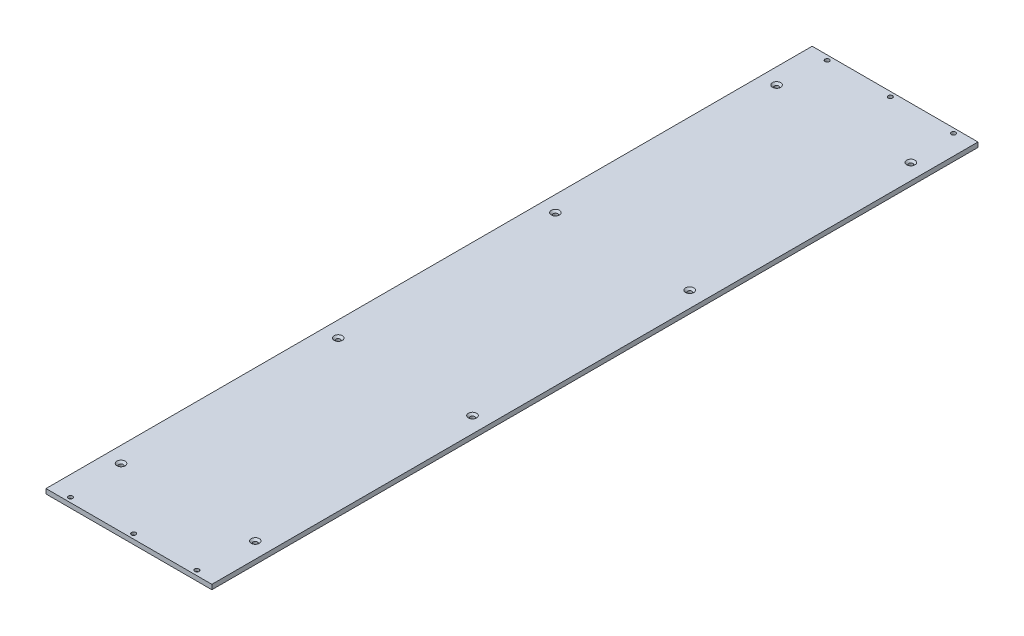
ISO-10303-21;
HEADER;
FILE_DESCRIPTION(('STEP AP214'),'2;1');
FILE_NAME('part.step','',(''),(''),'','','');
FILE_SCHEMA(('AUTOMOTIVE_DESIGN { 1 0 10303 214 1 1 1 1 }'));
ENDSEC;
DATA;
#1=APPLICATION_CONTEXT('core data for automotive mechanical design processes');
#2=APPLICATION_PROTOCOL_DEFINITION('international standard','automotive_design',2000,#1);
#3=PRODUCT_CONTEXT('',#1,'mechanical');
#4=PRODUCT('Part','Part','',(#3));
#5=PRODUCT_RELATED_PRODUCT_CATEGORY('part','',(#4));
#6=PRODUCT_DEFINITION_FORMATION('','',#4);
#7=PRODUCT_DEFINITION_CONTEXT('part definition',#1,'design');
#8=PRODUCT_DEFINITION('design','',#6,#7);
#9=PRODUCT_DEFINITION_SHAPE('','',#8);
#10=(LENGTH_UNIT() NAMED_UNIT(*) SI_UNIT(.MILLI.,.METRE.));
#11=(NAMED_UNIT(*) PLANE_ANGLE_UNIT() SI_UNIT($,.RADIAN.));
#12=(NAMED_UNIT(*) SI_UNIT($,.STERADIAN.) SOLID_ANGLE_UNIT());
#13=UNCERTAINTY_MEASURE_WITH_UNIT(LENGTH_MEASURE(1.E-05),#10,'distance_accuracy_value','');
#14=(GEOMETRIC_REPRESENTATION_CONTEXT(3) GLOBAL_UNCERTAINTY_ASSIGNED_CONTEXT((#13)) GLOBAL_UNIT_ASSIGNED_CONTEXT((#10,
#11,#12)) REPRESENTATION_CONTEXT('',''));
#15=CARTESIAN_POINT('',(0.,0.,0.));
#16=DIRECTION('',(0.,0.,1.));
#17=DIRECTION('',(1.,0.,0.));
#18=AXIS2_PLACEMENT_3D('',#15,#16,#17);
#19=CARTESIAN_POINT('',(0.,0.,0.));
#20=DIRECTION('',(0.,-1.,0.));
#21=DIRECTION('',(0.,0.,-1.));
#22=AXIS2_PLACEMENT_3D('',#19,#20,#21);
#23=PLANE('',#22);
#24=CARTESIAN_POINT('',(25.,0.,-964.));
#25=DIRECTION('',(0.,-1.,0.));
#26=DIRECTION('',(0.,0.,-1.));
#27=AXIS2_PLACEMENT_3D('',#24,#25,#26);
#28=CIRCLE('',#27,5.2);
#29=CARTESIAN_POINT('',(25.,0.,-969.2));
#30=VERTEX_POINT('',#29);
#31=EDGE_CURVE('E453',#30,#30,#28,.T.);
#32=ORIENTED_EDGE('',*,*,#31,.F.);
#33=EDGE_LOOP('',(#32));
#34=FACE_BOUND('',#33,.T.);
#35=CARTESIAN_POINT('',(185.,0.,-964.));
#36=DIRECTION('',(0.,-1.,0.));
#37=DIRECTION('',(0.,0.,-1.));
#38=AXIS2_PLACEMENT_3D('',#35,#36,#37);
#39=CIRCLE('',#38,5.20000000000001);
#40=CARTESIAN_POINT('',(185.,0.,-969.2));
#41=VERTEX_POINT('',#40);
#42=EDGE_CURVE('E459',#41,#41,#39,.T.);
#43=ORIENTED_EDGE('',*,*,#42,.F.);
#44=EDGE_LOOP('',(#43));
#45=FACE_BOUND('',#44,.T.);
#46=CARTESIAN_POINT('',(105.,0.,-964.));
#47=DIRECTION('',(0.,-1.,0.));
#48=DIRECTION('',(0.,0.,-1.));
#49=AXIS2_PLACEMENT_3D('',#46,#47,#48);
#50=CIRCLE('',#49,5.2);
#51=CARTESIAN_POINT('',(105.,0.,-969.2));
#52=VERTEX_POINT('',#51);
#53=EDGE_CURVE('E468',#52,#52,#50,.T.);
#54=ORIENTED_EDGE('',*,*,#53,.F.);
#55=EDGE_LOOP('',(#54));
#56=FACE_BOUND('',#55,.T.);
#57=CARTESIAN_POINT('',(25.,0.,-6.));
#58=DIRECTION('',(0.,-1.,0.));
#59=DIRECTION('',(0.,0.,-1.));
#60=AXIS2_PLACEMENT_3D('',#57,#58,#59);
#61=CIRCLE('',#60,5.2);
#62=CARTESIAN_POINT('',(25.,0.,-11.2));
#63=VERTEX_POINT('',#62);
#64=EDGE_CURVE('E477',#63,#63,#61,.T.);
#65=ORIENTED_EDGE('',*,*,#64,.F.);
#66=EDGE_LOOP('',(#65));
#67=FACE_BOUND('',#66,.T.);
#68=CARTESIAN_POINT('',(185.,0.,-6.));
#69=DIRECTION('',(0.,-1.,0.));
#70=DIRECTION('',(0.,0.,-1.));
#71=AXIS2_PLACEMENT_3D('',#68,#69,#70);
#72=CIRCLE('',#71,5.20000000000001);
#73=CARTESIAN_POINT('',(185.,0.,-11.2));
#74=VERTEX_POINT('',#73);
#75=EDGE_CURVE('E486',#74,#74,#72,.T.);
#76=ORIENTED_EDGE('',*,*,#75,.F.);
#77=EDGE_LOOP('',(#76));
#78=FACE_BOUND('',#77,.T.);
#79=CARTESIAN_POINT('',(105.,0.,-6.));
#80=DIRECTION('',(0.,-1.,0.));
#81=DIRECTION('',(0.,0.,-1.));
#82=AXIS2_PLACEMENT_3D('',#79,#80,#81);
#83=CIRCLE('',#82,5.2);
#84=CARTESIAN_POINT('',(105.,0.,-11.2));
#85=VERTEX_POINT('',#84);
#86=EDGE_CURVE('E495',#85,#85,#83,.T.);
#87=ORIENTED_EDGE('',*,*,#86,.F.);
#88=EDGE_LOOP('',(#87));
#89=FACE_BOUND('',#88,.T.);
#90=CARTESIAN_POINT('',(190.,0.,-905.));
#91=DIRECTION('',(0.,1.,0.));
#92=DIRECTION('',(0.,0.,1.));
#93=AXIS2_PLACEMENT_3D('',#90,#91,#92);
#94=CIRCLE('',#93,2.75);
#95=CARTESIAN_POINT('',(190.,0.,-902.25));
#96=VERTEX_POINT('',#95);
#97=EDGE_CURVE('E510',#96,#96,#94,.T.);
#98=ORIENTED_EDGE('',*,*,#97,.T.);
#99=EDGE_LOOP('',(#98));
#100=FACE_BOUND('',#99,.T.);
#101=CARTESIAN_POINT('',(20.,0.,-625.));
#102=DIRECTION('',(0.,1.,0.));
#103=DIRECTION('',(0.,0.,1.));
#104=AXIS2_PLACEMENT_3D('',#101,#102,#103);
#105=CIRCLE('',#104,2.75);
#106=CARTESIAN_POINT('',(20.,0.,-622.25));
#107=VERTEX_POINT('',#106);
#108=EDGE_CURVE('E42',#107,#107,#105,.T.);
#109=ORIENTED_EDGE('',*,*,#108,.T.);
#110=EDGE_LOOP('',(#109));
#111=FACE_BOUND('',#110,.T.);
#112=DIRECTION('',(0.,0.,1.));
#113=VECTOR('',#112,1.);
#114=CARTESIAN_POINT('',(0.,0.,0.));
#115=LINE('',#114,#113);
#116=CARTESIAN_POINT('',(0.,0.,-970.));
#117=VERTEX_POINT('',#116);
#118=CARTESIAN_POINT('',(0.,0.,0.));
#119=VERTEX_POINT('',#118);
#120=EDGE_CURVE('E102',#117,#119,#115,.T.);
#121=ORIENTED_EDGE('',*,*,#120,.F.);
#122=DIRECTION('',(-1.,0.,0.));
#123=VECTOR('',#122,1.);
#124=CARTESIAN_POINT('',(0.,0.,-970.));
#125=LINE('',#124,#123);
#126=CARTESIAN_POINT('',(210.,0.,-970.));
#127=VERTEX_POINT('',#126);
#128=EDGE_CURVE('E73',#127,#117,#125,.T.);
#129=ORIENTED_EDGE('',*,*,#128,.F.);
#130=DIRECTION('',(0.,0.,-1.));
#131=VECTOR('',#130,1.);
#132=CARTESIAN_POINT('',(210.,0.,0.));
#133=LINE('',#132,#131);
#134=CARTESIAN_POINT('',(210.,0.,0.));
#135=VERTEX_POINT('',#134);
#136=EDGE_CURVE('E67',#135,#127,#133,.T.);
#137=ORIENTED_EDGE('',*,*,#136,.F.);
#138=DIRECTION('',(1.,0.,0.));
#139=VECTOR('',#138,1.);
#140=CARTESIAN_POINT('',(0.,0.,0.));
#141=LINE('',#140,#139);
#142=EDGE_CURVE('E92',#119,#135,#141,.T.);
#143=ORIENTED_EDGE('',*,*,#142,.F.);
#144=EDGE_LOOP('',(#121,#129,#137,#143));
#145=FACE_BOUND('',#144,.T.);
#146=CARTESIAN_POINT('',(20.,0.,-75.));
#147=DIRECTION('',(0.,1.,0.));
#148=DIRECTION('',(0.,0.,1.));
#149=AXIS2_PLACEMENT_3D('',#146,#147,#148);
#150=CIRCLE('',#149,2.75);
#151=CARTESIAN_POINT('',(20.,0.,-72.25));
#152=VERTEX_POINT('',#151);
#153=EDGE_CURVE('E105',#152,#152,#150,.T.);
#154=ORIENTED_EDGE('',*,*,#153,.T.);
#155=EDGE_LOOP('',(#154));
#156=FACE_BOUND('',#155,.T.);
#157=CARTESIAN_POINT('',(20.,0.,-350.));
#158=DIRECTION('',(0.,1.,0.));
#159=DIRECTION('',(0.,0.,1.));
#160=AXIS2_PLACEMENT_3D('',#157,#158,#159);
#161=CIRCLE('',#160,2.75);
#162=CARTESIAN_POINT('',(20.,0.,-347.25));
#163=VERTEX_POINT('',#162);
#164=EDGE_CURVE('E552',#163,#163,#161,.T.);
#165=ORIENTED_EDGE('',*,*,#164,.T.);
#166=EDGE_LOOP('',(#165));
#167=FACE_BOUND('',#166,.T.);
#168=CARTESIAN_POINT('',(20.,0.,-905.));
#169=DIRECTION('',(0.,1.,0.));
#170=DIRECTION('',(0.,0.,1.));
#171=AXIS2_PLACEMENT_3D('',#168,#169,#170);
#172=CIRCLE('',#171,2.75);
#173=CARTESIAN_POINT('',(20.,0.,-902.25));
#174=VERTEX_POINT('',#173);
#175=EDGE_CURVE('E543',#174,#174,#172,.T.);
#176=ORIENTED_EDGE('',*,*,#175,.T.);
#177=EDGE_LOOP('',(#176));
#178=FACE_BOUND('',#177,.T.);
#179=CARTESIAN_POINT('',(190.,0.,-75.));
#180=DIRECTION('',(0.,1.,0.));
#181=DIRECTION('',(0.,0.,1.));
#182=AXIS2_PLACEMENT_3D('',#179,#180,#181);
#183=CIRCLE('',#182,2.75);
#184=CARTESIAN_POINT('',(190.,0.,-72.25));
#185=VERTEX_POINT('',#184);
#186=EDGE_CURVE('E537',#185,#185,#183,.T.);
#187=ORIENTED_EDGE('',*,*,#186,.T.);
#188=EDGE_LOOP('',(#187));
#189=FACE_BOUND('',#188,.T.);
#190=CARTESIAN_POINT('',(190.,0.,-350.));
#191=DIRECTION('',(0.,1.,0.));
#192=DIRECTION('',(0.,0.,1.));
#193=AXIS2_PLACEMENT_3D('',#190,#191,#192);
#194=CIRCLE('',#193,2.75);
#195=CARTESIAN_POINT('',(190.,0.,-347.25));
#196=VERTEX_POINT('',#195);
#197=EDGE_CURVE('E528',#196,#196,#194,.T.);
#198=ORIENTED_EDGE('',*,*,#197,.T.);
#199=EDGE_LOOP('',(#198));
#200=FACE_BOUND('',#199,.T.);
#201=CARTESIAN_POINT('',(190.,0.,-625.));
#202=DIRECTION('',(0.,1.,0.));
#203=DIRECTION('',(0.,0.,1.));
#204=AXIS2_PLACEMENT_3D('',#201,#202,#203);
#205=CIRCLE('',#204,2.75);
#206=CARTESIAN_POINT('',(190.,0.,-622.25));
#207=VERTEX_POINT('',#206);
#208=EDGE_CURVE('E519',#207,#207,#205,.T.);
#209=ORIENTED_EDGE('',*,*,#208,.T.);
#210=EDGE_LOOP('',(#209));
#211=FACE_BOUND('',#210,.T.);
#212=ADVANCED_FACE('F33',(#34,#45,#56,#67,#78,#89,#100,#111,#145,#156,#167,#178,#189,#200,#211),
#23,.T.);
#213=CARTESIAN_POINT('',(0.,6.,0.));
#214=DIRECTION('',(1.,0.,0.));
#215=DIRECTION('',(0.,0.,-1.));
#216=AXIS2_PLACEMENT_3D('',#213,#214,#215);
#217=PLANE('',#216);
#218=ORIENTED_EDGE('',*,*,#120,.T.);
#219=DIRECTION('',(0.,-1.,0.));
#220=VECTOR('',#219,1.);
#221=CARTESIAN_POINT('',(0.,6.,0.));
#222=LINE('',#221,#220);
#223=CARTESIAN_POINT('',(0.,6.,0.));
#224=VERTEX_POINT('',#223);
#225=EDGE_CURVE('E93',#224,#119,#222,.T.);
#226=ORIENTED_EDGE('',*,*,#225,.F.);
#227=DIRECTION('',(0.,0.,1.));
#228=VECTOR('',#227,1.);
#229=CARTESIAN_POINT('',(0.,6.,0.));
#230=LINE('',#229,#228);
#231=CARTESIAN_POINT('',(0.,6.,-970.));
#232=VERTEX_POINT('',#231);
#233=EDGE_CURVE('E87',#232,#224,#230,.T.);
#234=ORIENTED_EDGE('',*,*,#233,.F.);
#235=DIRECTION('',(0.,-1.,0.));
#236=VECTOR('',#235,1.);
#237=CARTESIAN_POINT('',(0.,6.,-970.));
#238=LINE('',#237,#236);
#239=EDGE_CURVE('E98',#232,#117,#238,.T.);
#240=ORIENTED_EDGE('',*,*,#239,.T.);
#241=EDGE_LOOP('',(#218,#226,#234,#240));
#242=FACE_BOUND('',#241,.T.);
#243=ADVANCED_FACE('F146',(#242),#217,.F.);
#244=CARTESIAN_POINT('',(0.,6.,0.));
#245=DIRECTION('',(0.,0.,-1.));
#246=DIRECTION('',(-1.,0.,0.));
#247=AXIS2_PLACEMENT_3D('',#244,#245,#246);
#248=PLANE('',#247);
#249=ORIENTED_EDGE('',*,*,#142,.T.);
#250=DIRECTION('',(0.,-1.,0.));
#251=VECTOR('',#250,1.);
#252=CARTESIAN_POINT('',(210.,6.,0.));
#253=LINE('',#252,#251);
#254=CARTESIAN_POINT('',(210.,6.,0.));
#255=VERTEX_POINT('',#254);
#256=EDGE_CURVE('E90',#255,#135,#253,.T.);
#257=ORIENTED_EDGE('',*,*,#256,.F.);
#258=DIRECTION('',(1.,0.,0.));
#259=VECTOR('',#258,1.);
#260=CARTESIAN_POINT('',(0.,6.,0.));
#261=LINE('',#260,#259);
#262=EDGE_CURVE('E81',#224,#255,#261,.T.);
#263=ORIENTED_EDGE('',*,*,#262,.F.);
#264=ORIENTED_EDGE('',*,*,#225,.T.);
#265=EDGE_LOOP('',(#249,#257,#263,#264));
#266=FACE_BOUND('',#265,.T.);
#267=ADVANCED_FACE('F91',(#266),#248,.F.);
#268=CARTESIAN_POINT('',(210.,6.,0.));
#269=DIRECTION('',(-1.,0.,0.));
#270=DIRECTION('',(0.,0.,1.));
#271=AXIS2_PLACEMENT_3D('',#268,#269,#270);
#272=PLANE('',#271);
#273=ORIENTED_EDGE('',*,*,#136,.T.);
#274=DIRECTION('',(0.,-1.,0.));
#275=VECTOR('',#274,1.);
#276=CARTESIAN_POINT('',(210.,6.,-970.));
#277=LINE('',#276,#275);
#278=CARTESIAN_POINT('',(210.,6.,-970.));
#279=VERTEX_POINT('',#278);
#280=EDGE_CURVE('E94',#279,#127,#277,.T.);
#281=ORIENTED_EDGE('',*,*,#280,.F.);
#282=DIRECTION('',(0.,0.,-1.));
#283=VECTOR('',#282,1.);
#284=CARTESIAN_POINT('',(210.,6.,0.));
#285=LINE('',#284,#283);
#286=EDGE_CURVE('E85',#255,#279,#285,.T.);
#287=ORIENTED_EDGE('',*,*,#286,.F.);
#288=ORIENTED_EDGE('',*,*,#256,.T.);
#289=EDGE_LOOP('',(#273,#281,#287,#288));
#290=FACE_BOUND('',#289,.T.);
#291=ADVANCED_FACE('F96',(#290),#272,.F.);
#292=CARTESIAN_POINT('',(0.,6.,-970.));
#293=DIRECTION('',(0.,0.,1.));
#294=DIRECTION('',(1.,0.,0.));
#295=AXIS2_PLACEMENT_3D('',#292,#293,#294);
#296=PLANE('',#295);
#297=ORIENTED_EDGE('',*,*,#128,.T.);
#298=ORIENTED_EDGE('',*,*,#239,.F.);
#299=DIRECTION('',(-1.,0.,0.));
#300=VECTOR('',#299,1.);
#301=CARTESIAN_POINT('',(0.,6.,-970.));
#302=LINE('',#301,#300);
#303=EDGE_CURVE('E50',#279,#232,#302,.T.);
#304=ORIENTED_EDGE('',*,*,#303,.F.);
#305=ORIENTED_EDGE('',*,*,#280,.T.);
#306=EDGE_LOOP('',(#297,#298,#304,#305));
#307=FACE_BOUND('',#306,.T.);
#308=ADVANCED_FACE('F131',(#307),#296,.F.);
#309=CARTESIAN_POINT('',(0.,6.,0.));
#310=DIRECTION('',(0.,-1.,0.));
#311=DIRECTION('',(0.,0.,-1.));
#312=AXIS2_PLACEMENT_3D('',#309,#310,#311);
#313=PLANE('',#312);
#314=CARTESIAN_POINT('',(25.,6.,-964.));
#315=DIRECTION('',(0.,-1.,0.));
#316=DIRECTION('',(0.,0.,-1.));
#317=AXIS2_PLACEMENT_3D('',#314,#315,#316);
#318=CIRCLE('',#317,2.75);
#319=CARTESIAN_POINT('',(25.,6.,-966.75));
#320=VERTEX_POINT('',#319);
#321=EDGE_CURVE('E455',#320,#320,#318,.T.);
#322=ORIENTED_EDGE('',*,*,#321,.T.);
#323=EDGE_LOOP('',(#322));
#324=FACE_BOUND('',#323,.T.);
#325=CARTESIAN_POINT('',(185.,6.,-964.));
#326=DIRECTION('',(0.,-1.,0.));
#327=DIRECTION('',(0.,0.,-1.));
#328=AXIS2_PLACEMENT_3D('',#325,#326,#327);
#329=CIRCLE('',#328,2.75);
#330=CARTESIAN_POINT('',(185.,6.,-966.75));
#331=VERTEX_POINT('',#330);
#332=EDGE_CURVE('E465',#331,#331,#329,.T.);
#333=ORIENTED_EDGE('',*,*,#332,.T.);
#334=EDGE_LOOP('',(#333));
#335=FACE_BOUND('',#334,.T.);
#336=CARTESIAN_POINT('',(105.,6.,-964.));
#337=DIRECTION('',(0.,-1.,0.));
#338=DIRECTION('',(0.,0.,-1.));
#339=AXIS2_PLACEMENT_3D('',#336,#337,#338);
#340=CIRCLE('',#339,2.75);
#341=CARTESIAN_POINT('',(105.,6.,-966.75));
#342=VERTEX_POINT('',#341);
#343=EDGE_CURVE('E474',#342,#342,#340,.T.);
#344=ORIENTED_EDGE('',*,*,#343,.T.);
#345=EDGE_LOOP('',(#344));
#346=FACE_BOUND('',#345,.T.);
#347=CARTESIAN_POINT('',(25.,6.,-6.));
#348=DIRECTION('',(0.,-1.,0.));
#349=DIRECTION('',(0.,0.,-1.));
#350=AXIS2_PLACEMENT_3D('',#347,#348,#349);
#351=CIRCLE('',#350,2.75);
#352=CARTESIAN_POINT('',(25.,6.,-8.75));
#353=VERTEX_POINT('',#352);
#354=EDGE_CURVE('E483',#353,#353,#351,.T.);
#355=ORIENTED_EDGE('',*,*,#354,.T.);
#356=EDGE_LOOP('',(#355));
#357=FACE_BOUND('',#356,.T.);
#358=CARTESIAN_POINT('',(185.,6.,-6.));
#359=DIRECTION('',(0.,-1.,0.));
#360=DIRECTION('',(0.,0.,-1.));
#361=AXIS2_PLACEMENT_3D('',#358,#359,#360);
#362=CIRCLE('',#361,2.75);
#363=CARTESIAN_POINT('',(185.,6.,-8.75));
#364=VERTEX_POINT('',#363);
#365=EDGE_CURVE('E492',#364,#364,#362,.T.);
#366=ORIENTED_EDGE('',*,*,#365,.T.);
#367=EDGE_LOOP('',(#366));
#368=FACE_BOUND('',#367,.T.);
#369=CARTESIAN_POINT('',(105.,6.,-6.));
#370=DIRECTION('',(0.,-1.,0.));
#371=DIRECTION('',(0.,0.,-1.));
#372=AXIS2_PLACEMENT_3D('',#369,#370,#371);
#373=CIRCLE('',#372,2.75);
#374=CARTESIAN_POINT('',(105.,6.,-8.75));
#375=VERTEX_POINT('',#374);
#376=EDGE_CURVE('E501',#375,#375,#373,.T.);
#377=ORIENTED_EDGE('',*,*,#376,.T.);
#378=EDGE_LOOP('',(#377));
#379=FACE_BOUND('',#378,.T.);
#380=CARTESIAN_POINT('',(190.,6.,-905.));
#381=DIRECTION('',(0.,1.,0.));
#382=DIRECTION('',(0.,0.,1.));
#383=AXIS2_PLACEMENT_3D('',#380,#381,#382);
#384=CIRCLE('',#383,5.20000000000001);
#385=CARTESIAN_POINT('',(190.,6.,-899.8));
#386=VERTEX_POINT('',#385);
#387=EDGE_CURVE('E504',#386,#386,#384,.T.);
#388=ORIENTED_EDGE('',*,*,#387,.F.);
#389=EDGE_LOOP('',(#388));
#390=FACE_BOUND('',#389,.T.);
#391=CARTESIAN_POINT('',(190.,6.,-625.));
#392=DIRECTION('',(0.,1.,0.));
#393=DIRECTION('',(0.,0.,1.));
#394=AXIS2_PLACEMENT_3D('',#391,#392,#393);
#395=CIRCLE('',#394,5.20000000000001);
#396=CARTESIAN_POINT('',(190.,6.,-619.8));
#397=VERTEX_POINT('',#396);
#398=EDGE_CURVE('E513',#397,#397,#395,.T.);
#399=ORIENTED_EDGE('',*,*,#398,.F.);
#400=EDGE_LOOP('',(#399));
#401=FACE_BOUND('',#400,.T.);
#402=CARTESIAN_POINT('',(190.,6.,-350.));
#403=DIRECTION('',(0.,1.,0.));
#404=DIRECTION('',(0.,0.,1.));
#405=AXIS2_PLACEMENT_3D('',#402,#403,#404);
#406=CIRCLE('',#405,5.20000000000001);
#407=CARTESIAN_POINT('',(190.,6.,-344.8));
#408=VERTEX_POINT('',#407);
#409=EDGE_CURVE('E522',#408,#408,#406,.T.);
#410=ORIENTED_EDGE('',*,*,#409,.F.);
#411=EDGE_LOOP('',(#410));
#412=FACE_BOUND('',#411,.T.);
#413=CARTESIAN_POINT('',(190.,6.,-75.));
#414=DIRECTION('',(0.,1.,0.));
#415=DIRECTION('',(0.,0.,1.));
#416=AXIS2_PLACEMENT_3D('',#413,#414,#415);
#417=CIRCLE('',#416,5.20000000000001);
#418=CARTESIAN_POINT('',(190.,6.,-69.8));
#419=VERTEX_POINT('',#418);
#420=EDGE_CURVE('E531',#419,#419,#417,.T.);
#421=ORIENTED_EDGE('',*,*,#420,.F.);
#422=EDGE_LOOP('',(#421));
#423=FACE_BOUND('',#422,.T.);
#424=CARTESIAN_POINT('',(20.,6.,-905.));
#425=DIRECTION('',(0.,1.,0.));
#426=DIRECTION('',(0.,0.,1.));
#427=AXIS2_PLACEMENT_3D('',#424,#425,#426);
#428=CIRCLE('',#427,5.2);
#429=CARTESIAN_POINT('',(20.,6.,-899.8));
#430=VERTEX_POINT('',#429);
#431=EDGE_CURVE('E540',#430,#430,#428,.T.);
#432=ORIENTED_EDGE('',*,*,#431,.F.);
#433=EDGE_LOOP('',(#432));
#434=FACE_BOUND('',#433,.T.);
#435=CARTESIAN_POINT('',(20.,6.,-350.));
#436=DIRECTION('',(0.,1.,0.));
#437=DIRECTION('',(0.,0.,1.));
#438=AXIS2_PLACEMENT_3D('',#435,#436,#437);
#439=CIRCLE('',#438,5.2);
#440=CARTESIAN_POINT('',(20.,6.,-344.8));
#441=VERTEX_POINT('',#440);
#442=EDGE_CURVE('E549',#441,#441,#439,.T.);
#443=ORIENTED_EDGE('',*,*,#442,.F.);
#444=EDGE_LOOP('',(#443));
#445=FACE_BOUND('',#444,.T.);
#446=CARTESIAN_POINT('',(20.,6.,-75.));
#447=DIRECTION('',(0.,1.,0.));
#448=DIRECTION('',(0.,0.,1.));
#449=AXIS2_PLACEMENT_3D('',#446,#447,#448);
#450=CIRCLE('',#449,5.2);
#451=CARTESIAN_POINT('',(20.,6.,-69.8));
#452=VERTEX_POINT('',#451);
#453=EDGE_CURVE('E558',#452,#452,#450,.T.);
#454=ORIENTED_EDGE('',*,*,#453,.F.);
#455=EDGE_LOOP('',(#454));
#456=FACE_BOUND('',#455,.T.);
#457=ORIENTED_EDGE('',*,*,#233,.T.);
#458=ORIENTED_EDGE('',*,*,#262,.T.);
#459=ORIENTED_EDGE('',*,*,#286,.T.);
#460=ORIENTED_EDGE('',*,*,#303,.T.);
#461=EDGE_LOOP('',(#457,#458,#459,#460));
#462=FACE_BOUND('',#461,.T.);
#463=CARTESIAN_POINT('',(20.,6.,-625.));
#464=DIRECTION('',(0.,1.,0.));
#465=DIRECTION('',(0.,0.,1.));
#466=AXIS2_PLACEMENT_3D('',#463,#464,#465);
#467=CIRCLE('',#466,5.2);
#468=CARTESIAN_POINT('',(20.,6.,-619.8));
#469=VERTEX_POINT('',#468);
#470=EDGE_CURVE('E112',#469,#469,#467,.T.);
#471=ORIENTED_EDGE('',*,*,#470,.F.);
#472=EDGE_LOOP('',(#471));
#473=FACE_BOUND('',#472,.T.);
#474=ADVANCED_FACE('F82',(#324,#335,#346,#357,#368,#379,#390,#401,#412,#423,#434,#445,#456,#462,
#473),#313,.F.);
#475=CARTESIAN_POINT('',(20.,6.,-75.));
#476=DIRECTION('',(0.,1.,0.));
#477=DIRECTION('',(0.,0.,1.));
#478=AXIS2_PLACEMENT_3D('',#475,#476,#477);
#479=CYLINDRICAL_SURFACE('',#478,2.75);
#480=ORIENTED_EDGE('',*,*,#153,.F.);
#481=EDGE_LOOP('',(#480));
#482=FACE_BOUND('',#481,.T.);
#483=CARTESIAN_POINT('',(20.,3.55,-75.));
#484=DIRECTION('',(0.,1.,0.));
#485=DIRECTION('',(0.,0.,1.));
#486=AXIS2_PLACEMENT_3D('',#483,#484,#485);
#487=CIRCLE('',#486,2.75);
#488=CARTESIAN_POINT('',(20.,3.55,-72.25));
#489=VERTEX_POINT('',#488);
#490=EDGE_CURVE('E561',#489,#489,#487,.T.);
#491=ORIENTED_EDGE('',*,*,#490,.T.);
#492=EDGE_LOOP('',(#491));
#493=FACE_BOUND('',#492,.T.);
#494=ADVANCED_FACE('F130',(#482,#493),#479,.F.);
#495=CARTESIAN_POINT('',(20.,6.,-75.));
#496=DIRECTION('',(0.,1.,0.));
#497=DIRECTION('',(0.,0.,1.));
#498=AXIS2_PLACEMENT_3D('',#495,#496,#497);
#499=CONICAL_SURFACE('',#498,5.2,0.785398163397448);
#500=ORIENTED_EDGE('',*,*,#490,.F.);
#501=EDGE_LOOP('',(#500));
#502=FACE_BOUND('',#501,.T.);
#503=ORIENTED_EDGE('',*,*,#453,.T.);
#504=EDGE_LOOP('',(#503));
#505=FACE_BOUND('',#504,.T.);
#506=ADVANCED_FACE('F138',(#502,#505),#499,.F.);
#507=CARTESIAN_POINT('',(20.,6.,-350.));
#508=DIRECTION('',(0.,1.,0.));
#509=DIRECTION('',(0.,0.,1.));
#510=AXIS2_PLACEMENT_3D('',#507,#508,#509);
#511=CYLINDRICAL_SURFACE('',#510,2.75);
#512=ORIENTED_EDGE('',*,*,#164,.F.);
#513=EDGE_LOOP('',(#512));
#514=FACE_BOUND('',#513,.T.);
#515=CARTESIAN_POINT('',(20.,3.55,-350.));
#516=DIRECTION('',(0.,1.,0.));
#517=DIRECTION('',(0.,0.,1.));
#518=AXIS2_PLACEMENT_3D('',#515,#516,#517);
#519=CIRCLE('',#518,2.75);
#520=CARTESIAN_POINT('',(20.,3.55,-347.25));
#521=VERTEX_POINT('',#520);
#522=EDGE_CURVE('E555',#521,#521,#519,.T.);
#523=ORIENTED_EDGE('',*,*,#522,.T.);
#524=EDGE_LOOP('',(#523));
#525=FACE_BOUND('',#524,.T.);
#526=ADVANCED_FACE('F187',(#514,#525),#511,.F.);
#527=CARTESIAN_POINT('',(20.,6.,-350.));
#528=DIRECTION('',(0.,1.,0.));
#529=DIRECTION('',(0.,0.,1.));
#530=AXIS2_PLACEMENT_3D('',#527,#528,#529);
#531=CONICAL_SURFACE('',#530,5.2,0.785398163397448);
#532=ORIENTED_EDGE('',*,*,#522,.F.);
#533=EDGE_LOOP('',(#532));
#534=FACE_BOUND('',#533,.T.);
#535=ORIENTED_EDGE('',*,*,#442,.T.);
#536=EDGE_LOOP('',(#535));
#537=FACE_BOUND('',#536,.T.);
#538=ADVANCED_FACE('F127',(#534,#537),#531,.F.);
#539=CARTESIAN_POINT('',(20.,6.,-625.));
#540=DIRECTION('',(0.,1.,0.));
#541=DIRECTION('',(0.,0.,1.));
#542=AXIS2_PLACEMENT_3D('',#539,#540,#541);
#543=CONICAL_SURFACE('',#542,5.2,0.785398163397448);
#544=CARTESIAN_POINT('',(20.,3.55,-625.));
#545=DIRECTION('',(0.,1.,0.));
#546=DIRECTION('',(0.,0.,1.));
#547=AXIS2_PLACEMENT_3D('',#544,#545,#546);
#548=CIRCLE('',#547,2.75);
#549=CARTESIAN_POINT('',(20.,3.55,-622.25));
#550=VERTEX_POINT('',#549);
#551=EDGE_CURVE('E11',#550,#550,#548,.T.);
#552=ORIENTED_EDGE('',*,*,#551,.F.);
#553=EDGE_LOOP('',(#552));
#554=FACE_BOUND('',#553,.T.);
#555=ORIENTED_EDGE('',*,*,#470,.T.);
#556=EDGE_LOOP('',(#555));
#557=FACE_BOUND('',#556,.T.);
#558=ADVANCED_FACE('F35',(#554,#557),#543,.F.);
#559=CARTESIAN_POINT('',(20.,6.,-625.));
#560=DIRECTION('',(0.,1.,0.));
#561=DIRECTION('',(0.,0.,1.));
#562=AXIS2_PLACEMENT_3D('',#559,#560,#561);
#563=CYLINDRICAL_SURFACE('',#562,2.75);
#564=ORIENTED_EDGE('',*,*,#108,.F.);
#565=EDGE_LOOP('',(#564));
#566=FACE_BOUND('',#565,.T.);
#567=ORIENTED_EDGE('',*,*,#551,.T.);
#568=EDGE_LOOP('',(#567));
#569=FACE_BOUND('',#568,.T.);
#570=ADVANCED_FACE('F119',(#566,#569),#563,.F.);
#571=CARTESIAN_POINT('',(20.,6.,-905.));
#572=DIRECTION('',(0.,1.,0.));
#573=DIRECTION('',(0.,0.,1.));
#574=AXIS2_PLACEMENT_3D('',#571,#572,#573);
#575=CYLINDRICAL_SURFACE('',#574,2.75);
#576=ORIENTED_EDGE('',*,*,#175,.F.);
#577=EDGE_LOOP('',(#576));
#578=FACE_BOUND('',#577,.T.);
#579=CARTESIAN_POINT('',(20.,3.55,-905.));
#580=DIRECTION('',(0.,1.,0.));
#581=DIRECTION('',(0.,0.,1.));
#582=AXIS2_PLACEMENT_3D('',#579,#580,#581);
#583=CIRCLE('',#582,2.75);
#584=CARTESIAN_POINT('',(20.,3.55,-902.25));
#585=VERTEX_POINT('',#584);
#586=EDGE_CURVE('E546',#585,#585,#583,.T.);
#587=ORIENTED_EDGE('',*,*,#586,.T.);
#588=EDGE_LOOP('',(#587));
#589=FACE_BOUND('',#588,.T.);
#590=ADVANCED_FACE('F122',(#578,#589),#575,.F.);
#591=CARTESIAN_POINT('',(20.,6.,-905.));
#592=DIRECTION('',(0.,1.,0.));
#593=DIRECTION('',(0.,0.,1.));
#594=AXIS2_PLACEMENT_3D('',#591,#592,#593);
#595=CONICAL_SURFACE('',#594,5.2,0.785398163397448);
#596=ORIENTED_EDGE('',*,*,#586,.F.);
#597=EDGE_LOOP('',(#596));
#598=FACE_BOUND('',#597,.T.);
#599=ORIENTED_EDGE('',*,*,#431,.T.);
#600=EDGE_LOOP('',(#599));
#601=FACE_BOUND('',#600,.T.);
#602=ADVANCED_FACE('F227',(#598,#601),#595,.F.);
#603=CARTESIAN_POINT('',(190.,6.,-75.));
#604=DIRECTION('',(0.,1.,0.));
#605=DIRECTION('',(0.,0.,1.));
#606=AXIS2_PLACEMENT_3D('',#603,#604,#605);
#607=CYLINDRICAL_SURFACE('',#606,2.75);
#608=ORIENTED_EDGE('',*,*,#186,.F.);
#609=EDGE_LOOP('',(#608));
#610=FACE_BOUND('',#609,.T.);
#611=CARTESIAN_POINT('',(190.,3.55,-75.));
#612=DIRECTION('',(0.,1.,0.));
#613=DIRECTION('',(0.,0.,1.));
#614=AXIS2_PLACEMENT_3D('',#611,#612,#613);
#615=CIRCLE('',#614,2.75);
#616=CARTESIAN_POINT('',(190.,3.55,-72.25));
#617=VERTEX_POINT('',#616);
#618=EDGE_CURVE('E534',#617,#617,#615,.T.);
#619=ORIENTED_EDGE('',*,*,#618,.T.);
#620=EDGE_LOOP('',(#619));
#621=FACE_BOUND('',#620,.T.);
#622=ADVANCED_FACE('F237',(#610,#621),#607,.F.);
#623=CARTESIAN_POINT('',(190.,6.,-75.));
#624=DIRECTION('',(0.,1.,0.));
#625=DIRECTION('',(0.,0.,1.));
#626=AXIS2_PLACEMENT_3D('',#623,#624,#625);
#627=CONICAL_SURFACE('',#626,5.20000000000001,0.785398163397449);
#628=ORIENTED_EDGE('',*,*,#618,.F.);
#629=EDGE_LOOP('',(#628));
#630=FACE_BOUND('',#629,.T.);
#631=ORIENTED_EDGE('',*,*,#420,.T.);
#632=EDGE_LOOP('',(#631));
#633=FACE_BOUND('',#632,.T.);
#634=ADVANCED_FACE('F248',(#630,#633),#627,.F.);
#635=CARTESIAN_POINT('',(190.,6.,-350.));
#636=DIRECTION('',(0.,1.,0.));
#637=DIRECTION('',(0.,0.,1.));
#638=AXIS2_PLACEMENT_3D('',#635,#636,#637);
#639=CYLINDRICAL_SURFACE('',#638,2.75);
#640=ORIENTED_EDGE('',*,*,#197,.F.);
#641=EDGE_LOOP('',(#640));
#642=FACE_BOUND('',#641,.T.);
#643=CARTESIAN_POINT('',(190.,3.55,-350.));
#644=DIRECTION('',(0.,1.,0.));
#645=DIRECTION('',(0.,0.,1.));
#646=AXIS2_PLACEMENT_3D('',#643,#644,#645);
#647=CIRCLE('',#646,2.75);
#648=CARTESIAN_POINT('',(190.,3.55,-347.25));
#649=VERTEX_POINT('',#648);
#650=EDGE_CURVE('E525',#649,#649,#647,.T.);
#651=ORIENTED_EDGE('',*,*,#650,.T.);
#652=EDGE_LOOP('',(#651));
#653=FACE_BOUND('',#652,.T.);
#654=ADVANCED_FACE('F258',(#642,#653),#639,.F.);
#655=CARTESIAN_POINT('',(190.,6.,-350.));
#656=DIRECTION('',(0.,1.,0.));
#657=DIRECTION('',(0.,0.,1.));
#658=AXIS2_PLACEMENT_3D('',#655,#656,#657);
#659=CONICAL_SURFACE('',#658,5.20000000000001,0.785398163397449);
#660=ORIENTED_EDGE('',*,*,#650,.F.);
#661=EDGE_LOOP('',(#660));
#662=FACE_BOUND('',#661,.T.);
#663=ORIENTED_EDGE('',*,*,#409,.T.);
#664=EDGE_LOOP('',(#663));
#665=FACE_BOUND('',#664,.T.);
#666=ADVANCED_FACE('F268',(#662,#665),#659,.F.);
#667=CARTESIAN_POINT('',(190.,6.,-625.));
#668=DIRECTION('',(0.,1.,0.));
#669=DIRECTION('',(0.,0.,1.));
#670=AXIS2_PLACEMENT_3D('',#667,#668,#669);
#671=CYLINDRICAL_SURFACE('',#670,2.75);
#672=ORIENTED_EDGE('',*,*,#208,.F.);
#673=EDGE_LOOP('',(#672));
#674=FACE_BOUND('',#673,.T.);
#675=CARTESIAN_POINT('',(190.,3.55,-625.));
#676=DIRECTION('',(0.,1.,0.));
#677=DIRECTION('',(0.,0.,1.));
#678=AXIS2_PLACEMENT_3D('',#675,#676,#677);
#679=CIRCLE('',#678,2.75);
#680=CARTESIAN_POINT('',(190.,3.55,-622.25));
#681=VERTEX_POINT('',#680);
#682=EDGE_CURVE('E516',#681,#681,#679,.T.);
#683=ORIENTED_EDGE('',*,*,#682,.T.);
#684=EDGE_LOOP('',(#683));
#685=FACE_BOUND('',#684,.T.);
#686=ADVANCED_FACE('F278',(#674,#685),#671,.F.);
#687=CARTESIAN_POINT('',(190.,6.,-625.));
#688=DIRECTION('',(0.,1.,0.));
#689=DIRECTION('',(0.,0.,1.));
#690=AXIS2_PLACEMENT_3D('',#687,#688,#689);
#691=CONICAL_SURFACE('',#690,5.20000000000001,0.785398163397449);
#692=ORIENTED_EDGE('',*,*,#682,.F.);
#693=EDGE_LOOP('',(#692));
#694=FACE_BOUND('',#693,.T.);
#695=ORIENTED_EDGE('',*,*,#398,.T.);
#696=EDGE_LOOP('',(#695));
#697=FACE_BOUND('',#696,.T.);
#698=ADVANCED_FACE('F288',(#694,#697),#691,.F.);
#699=CARTESIAN_POINT('',(190.,6.,-905.));
#700=DIRECTION('',(0.,1.,0.));
#701=DIRECTION('',(0.,0.,1.));
#702=AXIS2_PLACEMENT_3D('',#699,#700,#701);
#703=CYLINDRICAL_SURFACE('',#702,2.75);
#704=ORIENTED_EDGE('',*,*,#97,.F.);
#705=EDGE_LOOP('',(#704));
#706=FACE_BOUND('',#705,.T.);
#707=CARTESIAN_POINT('',(190.,3.55,-905.));
#708=DIRECTION('',(0.,1.,0.));
#709=DIRECTION('',(0.,0.,1.));
#710=AXIS2_PLACEMENT_3D('',#707,#708,#709);
#711=CIRCLE('',#710,2.75);
#712=CARTESIAN_POINT('',(190.,3.55,-902.25));
#713=VERTEX_POINT('',#712);
#714=EDGE_CURVE('E507',#713,#713,#711,.T.);
#715=ORIENTED_EDGE('',*,*,#714,.T.);
#716=EDGE_LOOP('',(#715));
#717=FACE_BOUND('',#716,.T.);
#718=ADVANCED_FACE('F298',(#706,#717),#703,.F.);
#719=CARTESIAN_POINT('',(190.,6.,-905.));
#720=DIRECTION('',(0.,1.,0.));
#721=DIRECTION('',(0.,0.,1.));
#722=AXIS2_PLACEMENT_3D('',#719,#720,#721);
#723=CONICAL_SURFACE('',#722,5.20000000000001,0.785398163397449);
#724=ORIENTED_EDGE('',*,*,#714,.F.);
#725=EDGE_LOOP('',(#724));
#726=FACE_BOUND('',#725,.T.);
#727=ORIENTED_EDGE('',*,*,#387,.T.);
#728=EDGE_LOOP('',(#727));
#729=FACE_BOUND('',#728,.T.);
#730=ADVANCED_FACE('F308',(#726,#729),#723,.F.);
#731=CARTESIAN_POINT('',(105.,0.,-6.));
#732=DIRECTION('',(0.,-1.,0.));
#733=DIRECTION('',(0.,0.,-1.));
#734=AXIS2_PLACEMENT_3D('',#731,#732,#733);
#735=CYLINDRICAL_SURFACE('',#734,2.75);
#736=ORIENTED_EDGE('',*,*,#376,.F.);
#737=EDGE_LOOP('',(#736));
#738=FACE_BOUND('',#737,.T.);
#739=CARTESIAN_POINT('',(105.,2.45000000000001,-6.));
#740=DIRECTION('',(0.,-1.,0.));
#741=DIRECTION('',(0.,0.,-1.));
#742=AXIS2_PLACEMENT_3D('',#739,#740,#741);
#743=CIRCLE('',#742,2.74999999999999);
#744=CARTESIAN_POINT('',(105.,2.45000000000001,-8.74999999999999));
#745=VERTEX_POINT('',#744);
#746=EDGE_CURVE('E498',#745,#745,#743,.T.);
#747=ORIENTED_EDGE('',*,*,#746,.T.);
#748=EDGE_LOOP('',(#747));
#749=FACE_BOUND('',#748,.T.);
#750=ADVANCED_FACE('F318',(#738,#749),#735,.F.);
#751=CARTESIAN_POINT('',(105.,0.,-6.));
#752=DIRECTION('',(0.,-1.,0.));
#753=DIRECTION('',(0.,0.,-1.));
#754=AXIS2_PLACEMENT_3D('',#751,#752,#753);
#755=CONICAL_SURFACE('',#754,5.2,0.785398163397448);
#756=ORIENTED_EDGE('',*,*,#746,.F.);
#757=EDGE_LOOP('',(#756));
#758=FACE_BOUND('',#757,.T.);
#759=ORIENTED_EDGE('',*,*,#86,.T.);
#760=EDGE_LOOP('',(#759));
#761=FACE_BOUND('',#760,.T.);
#762=ADVANCED_FACE('F328',(#758,#761),#755,.F.);
#763=CARTESIAN_POINT('',(185.,0.,-6.));
#764=DIRECTION('',(0.,-1.,0.));
#765=DIRECTION('',(0.,0.,-1.));
#766=AXIS2_PLACEMENT_3D('',#763,#764,#765);
#767=CYLINDRICAL_SURFACE('',#766,2.74999999999999);
#768=ORIENTED_EDGE('',*,*,#365,.F.);
#769=EDGE_LOOP('',(#768));
#770=FACE_BOUND('',#769,.T.);
#771=CARTESIAN_POINT('',(185.,2.45000000000001,-6.));
#772=DIRECTION('',(0.,-1.,0.));
#773=DIRECTION('',(0.,0.,-1.));
#774=AXIS2_PLACEMENT_3D('',#771,#772,#773);
#775=CIRCLE('',#774,2.74999999999997);
#776=CARTESIAN_POINT('',(185.,2.45000000000001,-8.74999999999998));
#777=VERTEX_POINT('',#776);
#778=EDGE_CURVE('E489',#777,#777,#775,.T.);
#779=ORIENTED_EDGE('',*,*,#778,.T.);
#780=EDGE_LOOP('',(#779));
#781=FACE_BOUND('',#780,.T.);
#782=ADVANCED_FACE('F338',(#770,#781),#767,.F.);
#783=CARTESIAN_POINT('',(185.,0.,-6.));
#784=DIRECTION('',(0.,-1.,0.));
#785=DIRECTION('',(0.,0.,-1.));
#786=AXIS2_PLACEMENT_3D('',#783,#784,#785);
#787=CONICAL_SURFACE('',#786,5.20000000000001,0.785398163397454);
#788=ORIENTED_EDGE('',*,*,#778,.F.);
#789=EDGE_LOOP('',(#788));
#790=FACE_BOUND('',#789,.T.);
#791=ORIENTED_EDGE('',*,*,#75,.T.);
#792=EDGE_LOOP('',(#791));
#793=FACE_BOUND('',#792,.T.);
#794=ADVANCED_FACE('F348',(#790,#793),#787,.F.);
#795=CARTESIAN_POINT('',(25.,0.,-6.));
#796=DIRECTION('',(0.,-1.,0.));
#797=DIRECTION('',(0.,0.,-1.));
#798=AXIS2_PLACEMENT_3D('',#795,#796,#797);
#799=CYLINDRICAL_SURFACE('',#798,2.74999999999999);
#800=ORIENTED_EDGE('',*,*,#354,.F.);
#801=EDGE_LOOP('',(#800));
#802=FACE_BOUND('',#801,.T.);
#803=CARTESIAN_POINT('',(25.,2.45000000000001,-6.));
#804=DIRECTION('',(0.,-1.,0.));
#805=DIRECTION('',(0.,0.,-1.));
#806=AXIS2_PLACEMENT_3D('',#803,#804,#805);
#807=CIRCLE('',#806,2.74999999999999);
#808=CARTESIAN_POINT('',(25.,2.45000000000001,-8.74999999999999));
#809=VERTEX_POINT('',#808);
#810=EDGE_CURVE('E480',#809,#809,#807,.T.);
#811=ORIENTED_EDGE('',*,*,#810,.T.);
#812=EDGE_LOOP('',(#811));
#813=FACE_BOUND('',#812,.T.);
#814=ADVANCED_FACE('F358',(#802,#813),#799,.F.);
#815=CARTESIAN_POINT('',(25.,0.,-6.));
#816=DIRECTION('',(0.,-1.,0.));
#817=DIRECTION('',(0.,0.,-1.));
#818=AXIS2_PLACEMENT_3D('',#815,#816,#817);
#819=CONICAL_SURFACE('',#818,5.2,0.785398163397449);
#820=ORIENTED_EDGE('',*,*,#810,.F.);
#821=EDGE_LOOP('',(#820));
#822=FACE_BOUND('',#821,.T.);
#823=ORIENTED_EDGE('',*,*,#64,.T.);
#824=EDGE_LOOP('',(#823));
#825=FACE_BOUND('',#824,.T.);
#826=ADVANCED_FACE('F368',(#822,#825),#819,.F.);
#827=CARTESIAN_POINT('',(105.,0.,-964.));
#828=DIRECTION('',(0.,-1.,0.));
#829=DIRECTION('',(0.,0.,-1.));
#830=AXIS2_PLACEMENT_3D('',#827,#828,#829);
#831=CYLINDRICAL_SURFACE('',#830,2.75);
#832=ORIENTED_EDGE('',*,*,#343,.F.);
#833=EDGE_LOOP('',(#832));
#834=FACE_BOUND('',#833,.T.);
#835=CARTESIAN_POINT('',(105.,2.45000000000001,-964.));
#836=DIRECTION('',(0.,-1.,0.));
#837=DIRECTION('',(0.,0.,-1.));
#838=AXIS2_PLACEMENT_3D('',#835,#836,#837);
#839=CIRCLE('',#838,2.74999999999999);
#840=CARTESIAN_POINT('',(105.,2.45000000000001,-966.75));
#841=VERTEX_POINT('',#840);
#842=EDGE_CURVE('E471',#841,#841,#839,.T.);
#843=ORIENTED_EDGE('',*,*,#842,.T.);
#844=EDGE_LOOP('',(#843));
#845=FACE_BOUND('',#844,.T.);
#846=ADVANCED_FACE('F377',(#834,#845),#831,.F.);
#847=CARTESIAN_POINT('',(105.,0.,-964.));
#848=DIRECTION('',(0.,-1.,0.));
#849=DIRECTION('',(0.,0.,-1.));
#850=AXIS2_PLACEMENT_3D('',#847,#848,#849);
#851=CONICAL_SURFACE('',#850,5.2,0.785398163397448);
#852=ORIENTED_EDGE('',*,*,#842,.F.);
#853=EDGE_LOOP('',(#852));
#854=FACE_BOUND('',#853,.T.);
#855=ORIENTED_EDGE('',*,*,#53,.T.);
#856=EDGE_LOOP('',(#855));
#857=FACE_BOUND('',#856,.T.);
#858=ADVANCED_FACE('F394',(#854,#857),#851,.F.);
#859=CARTESIAN_POINT('',(185.,0.,-964.));
#860=DIRECTION('',(0.,-1.,0.));
#861=DIRECTION('',(0.,0.,-1.));
#862=AXIS2_PLACEMENT_3D('',#859,#860,#861);
#863=CYLINDRICAL_SURFACE('',#862,2.74999999999999);
#864=ORIENTED_EDGE('',*,*,#332,.F.);
#865=EDGE_LOOP('',(#864));
#866=FACE_BOUND('',#865,.T.);
#867=CARTESIAN_POINT('',(185.,2.45000000000001,-964.));
#868=DIRECTION('',(0.,-1.,0.));
#869=DIRECTION('',(0.,0.,-1.));
#870=AXIS2_PLACEMENT_3D('',#867,#868,#869);
#871=CIRCLE('',#870,2.74999999999997);
#872=CARTESIAN_POINT('',(185.,2.45000000000001,-966.75));
#873=VERTEX_POINT('',#872);
#874=EDGE_CURVE('E462',#873,#873,#871,.T.);
#875=ORIENTED_EDGE('',*,*,#874,.T.);
#876=EDGE_LOOP('',(#875));
#877=FACE_BOUND('',#876,.T.);
#878=ADVANCED_FACE('F404',(#866,#877),#863,.F.);
#879=CARTESIAN_POINT('',(185.,0.,-964.));
#880=DIRECTION('',(0.,-1.,0.));
#881=DIRECTION('',(0.,0.,-1.));
#882=AXIS2_PLACEMENT_3D('',#879,#880,#881);
#883=CONICAL_SURFACE('',#882,5.20000000000001,0.785398163397454);
#884=ORIENTED_EDGE('',*,*,#874,.F.);
#885=EDGE_LOOP('',(#884));
#886=FACE_BOUND('',#885,.T.);
#887=ORIENTED_EDGE('',*,*,#42,.T.);
#888=EDGE_LOOP('',(#887));
#889=FACE_BOUND('',#888,.T.);
#890=ADVANCED_FACE('F414',(#886,#889),#883,.F.);
#891=CARTESIAN_POINT('',(25.,0.,-964.));
#892=DIRECTION('',(0.,-1.,0.));
#893=DIRECTION('',(0.,0.,-1.));
#894=AXIS2_PLACEMENT_3D('',#891,#892,#893);
#895=CYLINDRICAL_SURFACE('',#894,2.74999999999999);
#896=ORIENTED_EDGE('',*,*,#321,.F.);
#897=EDGE_LOOP('',(#896));
#898=FACE_BOUND('',#897,.T.);
#899=CARTESIAN_POINT('',(25.,2.45000000000001,-964.));
#900=DIRECTION('',(0.,-1.,0.));
#901=DIRECTION('',(0.,0.,-1.));
#902=AXIS2_PLACEMENT_3D('',#899,#900,#901);
#903=CIRCLE('',#902,2.74999999999999);
#904=CARTESIAN_POINT('',(25.,2.45000000000001,-966.75));
#905=VERTEX_POINT('',#904);
#906=EDGE_CURVE('E451',#905,#905,#903,.T.);
#907=ORIENTED_EDGE('',*,*,#906,.T.);
#908=EDGE_LOOP('',(#907));
#909=FACE_BOUND('',#908,.T.);
#910=ADVANCED_FACE('F424',(#898,#909),#895,.F.);
#911=CARTESIAN_POINT('',(25.,0.,-964.));
#912=DIRECTION('',(0.,-1.,0.));
#913=DIRECTION('',(0.,0.,-1.));
#914=AXIS2_PLACEMENT_3D('',#911,#912,#913);
#915=CONICAL_SURFACE('',#914,5.2,0.785398163397449);
#916=ORIENTED_EDGE('',*,*,#906,.F.);
#917=EDGE_LOOP('',(#916));
#918=FACE_BOUND('',#917,.T.);
#919=ORIENTED_EDGE('',*,*,#31,.T.);
#920=EDGE_LOOP('',(#919));
#921=FACE_BOUND('',#920,.T.);
#922=ADVANCED_FACE('F434',(#918,#921),#915,.F.);
#923=CLOSED_SHELL('',(#212,#243,#267,#291,#308,#474,#494,#506,#526,#538,#558,#570,#590,#602,
#622,#634,#654,#666,#686,#698,#718,#730,#750,#762,#782,#794,#814,#826,#846,#858,#878,#890,#910,#922));
#924=MANIFOLD_SOLID_BREP('B2',#923);
#925=ADVANCED_BREP_SHAPE_REPRESENTATION('',(#18,#924),#14);
#926=SHAPE_DEFINITION_REPRESENTATION(#9,#925);
ENDSEC;
END-ISO-10303-21;
